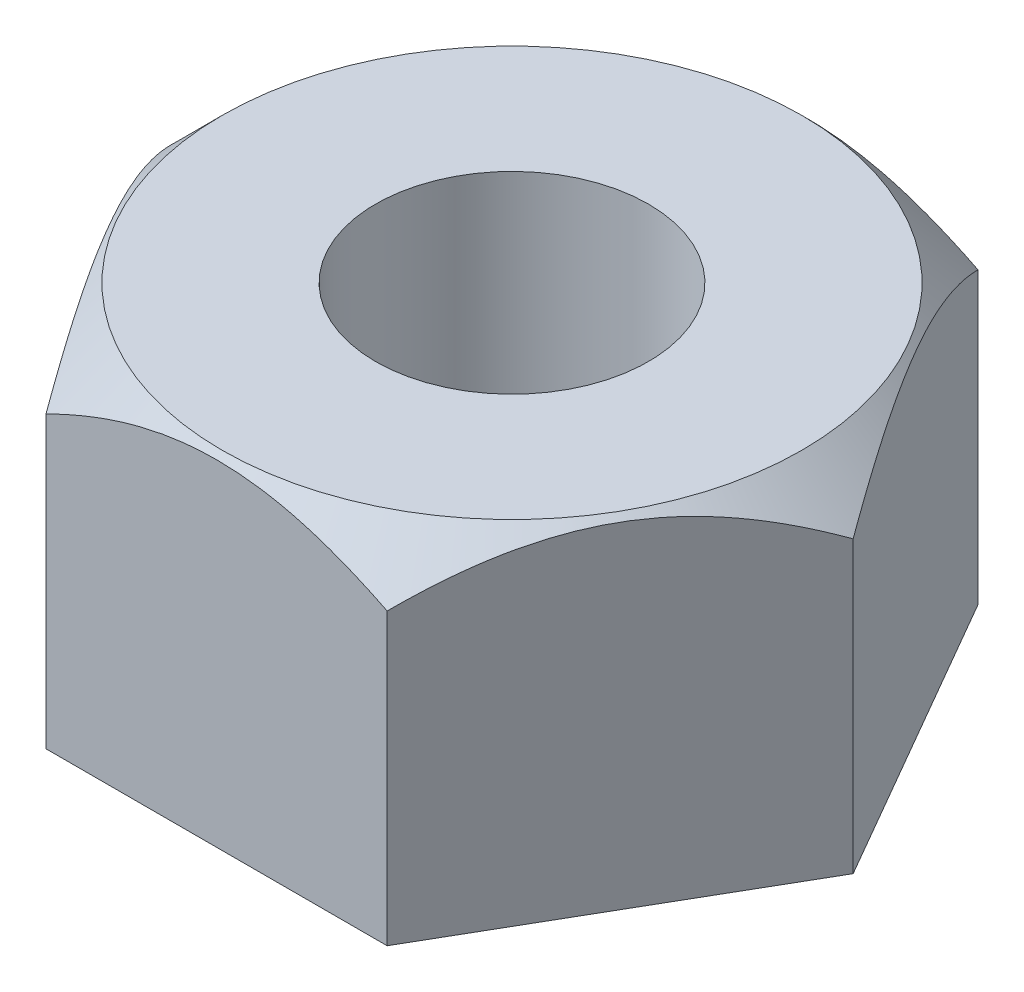
ISO-10303-21;
HEADER;
FILE_DESCRIPTION(('STEP AP214'),'2;1');
FILE_NAME('part.step','',(''),(''),'','','');
FILE_SCHEMA(('AUTOMOTIVE_DESIGN { 1 0 10303 214 1 1 1 1 }'));
ENDSEC;
DATA;
#1=APPLICATION_CONTEXT('core data for automotive mechanical design processes');
#2=APPLICATION_PROTOCOL_DEFINITION('international standard','automotive_design',2000,#1);
#3=PRODUCT_CONTEXT('',#1,'mechanical');
#4=PRODUCT('Part','Part','',(#3));
#5=PRODUCT_RELATED_PRODUCT_CATEGORY('part','',(#4));
#6=PRODUCT_DEFINITION_FORMATION('','',#4);
#7=PRODUCT_DEFINITION_CONTEXT('part definition',#1,'design');
#8=PRODUCT_DEFINITION('design','',#6,#7);
#9=PRODUCT_DEFINITION_SHAPE('','',#8);
#10=(LENGTH_UNIT() NAMED_UNIT(*) SI_UNIT(.MILLI.,.METRE.));
#11=(NAMED_UNIT(*) PLANE_ANGLE_UNIT() SI_UNIT($,.RADIAN.));
#12=(NAMED_UNIT(*) SI_UNIT($,.STERADIAN.) SOLID_ANGLE_UNIT());
#13=UNCERTAINTY_MEASURE_WITH_UNIT(LENGTH_MEASURE(1.E-05),#10,'distance_accuracy_value','');
#14=(GEOMETRIC_REPRESENTATION_CONTEXT(3) GLOBAL_UNCERTAINTY_ASSIGNED_CONTEXT((#13)) GLOBAL_UNIT_ASSIGNED_CONTEXT((#10,
#11,#12)) REPRESENTATION_CONTEXT('',''));
#15=CARTESIAN_POINT('',(0.,0.,0.));
#16=DIRECTION('',(0.,0.,1.));
#17=DIRECTION('',(1.,0.,0.));
#18=AXIS2_PLACEMENT_3D('',#15,#16,#17);
#19=CARTESIAN_POINT('',(0.,5.,0.));
#20=DIRECTION('',(0.,1.,0.));
#21=DIRECTION('',(0.,0.,1.));
#22=AXIS2_PLACEMENT_3D('',#19,#20,#21);
#23=PLANE('',#22);
#24=CARTESIAN_POINT('',(0.,5.,0.));
#25=DIRECTION('',(0.,1.,0.));
#26=DIRECTION('',(0.,0.,1.));
#27=AXIS2_PLACEMENT_3D('',#24,#25,#26);
#28=CIRCLE('',#27,2.);
#29=CARTESIAN_POINT('',(0.,5.,2.));
#30=VERTEX_POINT('',#29);
#31=EDGE_CURVE('E136',#30,#30,#28,.T.);
#32=ORIENTED_EDGE('',*,*,#31,.F.);
#33=EDGE_LOOP('',(#32));
#34=FACE_BOUND('',#33,.T.);
#35=CARTESIAN_POINT('',(0.,5.,0.));
#36=DIRECTION('',(0.,1.,0.));
#37=DIRECTION('',(0.,0.,1.));
#38=AXIS2_PLACEMENT_3D('',#35,#36,#37);
#39=CIRCLE('',#38,4.25);
#40=CARTESIAN_POINT('',(0.,5.,4.25));
#41=VERTEX_POINT('',#40);
#42=EDGE_CURVE('E199',#41,#41,#39,.T.);
#43=ORIENTED_EDGE('',*,*,#42,.T.);
#44=EDGE_LOOP('',(#43));
#45=FACE_BOUND('',#44,.T.);
#46=ADVANCED_FACE('F38',(#34,#45),#23,.T.);
#47=CARTESIAN_POINT('',(2.50000000000005,5.,4.33012701892216));
#48=DIRECTION('',(-0.866025403784441,0.,-0.499999999999995));
#49=DIRECTION('',(-0.499999999999995,0.,0.866025403784441));
#50=AXIS2_PLACEMENT_3D('',#47,#48,#49);
#51=PLANE('',#50);
#52=CARTESIAN_POINT('',(2.49988452994621,4.24988452594626,4.33032701892216));
#53=CARTESIAN_POINT('',(2.54287138041581,4.29286790141724,4.25587160985146));
#54=CARTESIAN_POINT('',(2.5861886533099,4.33453221602493,4.18084389235356));
#55=CARTESIAN_POINT('',(2.67354887274439,4.41482145708143,4.02953155373265));
#56=CARTESIAN_POINT('',(2.717592199979,4.45344472346907,3.95324627322793));
#57=CARTESIAN_POINT('',(2.85131771209202,4.56448044206777,3.72162689198));
#58=CARTESIAN_POINT('',(2.94213197757918,4.63158509551094,3.56433197010419));
#59=CARTESIAN_POINT('',(3.12526622915862,4.74649734778531,3.2471341417625));
#60=CARTESIAN_POINT('',(3.21753940303063,4.79459446311372,3.08731231644054));
#61=CARTESIAN_POINT('',(3.35746623690529,4.85023112471792,2.84495193082738));
#62=CARTESIAN_POINT('',(3.40431453249367,4.86601773556801,2.7638083026203));
#63=CARTESIAN_POINT('',(3.49840781373643,4.89173070196771,2.60083395885697));
#64=CARTESIAN_POINT('',(3.54565273902896,4.90165793340976,2.51900334785051));
#65=CARTESIAN_POINT('',(3.66078037944809,4.91830217314389,2.31959642528905));
#66=CARTESIAN_POINT('',(3.72878713668332,4.92179465880338,2.20180526649963));
#67=CARTESIAN_POINT('',(3.864678097949,4.91593410386714,1.9664352172981));
#68=CARTESIAN_POINT('',(3.93256225066697,4.90657656026428,1.8488564157618));
#69=CARTESIAN_POINT('',(4.06769057590288,4.87556753841817,1.61480729091151));
#70=CARTESIAN_POINT('',(4.13493394699396,4.85390231052961,1.49833835570955));
#71=CARTESIAN_POINT('',(4.26826494691759,4.79945578592571,1.26740228961786));
#72=CARTESIAN_POINT('',(4.33435266395689,4.76667534152198,1.15293500594956));
#73=CARTESIAN_POINT('',(4.4516735537138,4.69923386131425,0.949729264101406));
#74=CARTESIAN_POINT('',(4.50316644513572,4.66634609377105,0.860540959930006));
#75=CARTESIAN_POINT('',(4.60522781060439,4.59527048015555,0.683765489448405));
#76=CARTESIAN_POINT('',(4.6557962564957,4.55708247295944,0.596178371904862));
#77=CARTESIAN_POINT('',(4.7558494637635,4.47626249862795,0.422881133456812));
#78=CARTESIAN_POINT('',(4.80533707077894,4.4336445061233,0.337166083761062));
#79=CARTESIAN_POINT('',(4.90339584958639,4.34452416373331,0.167323296738404));
#80=CARTESIAN_POINT('',(4.95196756146993,4.29802419677496,0.0831946239455066));
#81=CARTESIAN_POINT('',(5.00011547005384,4.24988452594626,-0.000199999999999411));
#82=B_SPLINE_CURVE_WITH_KNOTS('',3,(#52,#53,#54,#55,#56,#57,#58,#59,#60,#61,#62,#63,#64,#65,#66,
#67,#68,#69,#70,#71,#72,#73,#74,#75,#76,#77,#78,#79,#80,#81),.UNSPECIFIED.,.F.,.F.,(4,2,2,2,2,2,
2,2,2,2,2,2,2,2,4),(0.,0.288343025050059,0.576842376266664,1.15695604992331,1.7278574729651,
2.01274823950901,2.29759640821261,2.70513724110402,3.11282092407138,3.52096095288676,
3.92906969271703,4.25324617843567,4.57743252106519,4.90062556888116,5.22362166510132),.UNSPECIFIED.);
#83=CARTESIAN_POINT('',(2.50000000000005,4.25,4.33012701892216));
#84=VERTEX_POINT('',#83);
#85=CARTESIAN_POINT('',(5.,4.25,0.));
#86=VERTEX_POINT('',#85);
#87=EDGE_CURVE('E97',#84,#86,#82,.T.);
#88=ORIENTED_EDGE('',*,*,#87,.F.);
#89=DIRECTION('',(0.,-1.,0.));
#90=VECTOR('',#89,1.);
#91=CARTESIAN_POINT('',(2.50000000000005,5.,4.33012701892216));
#92=LINE('',#91,#90);
#93=CARTESIAN_POINT('',(2.50000000000005,0.,4.33012701892216));
#94=VERTEX_POINT('',#93);
#95=EDGE_CURVE('E67',#84,#94,#92,.T.);
#96=ORIENTED_EDGE('',*,*,#95,.T.);
#97=DIRECTION('',(0.499999999999995,0.,-0.866025403784441));
#98=VECTOR('',#97,1.);
#99=CARTESIAN_POINT('',(2.50000000000005,0.,4.33012701892216));
#100=LINE('',#99,#98);
#101=CARTESIAN_POINT('',(5.,0.,0.));
#102=VERTEX_POINT('',#101);
#103=EDGE_CURVE('E131',#94,#102,#100,.T.);
#104=ORIENTED_EDGE('',*,*,#103,.T.);
#105=DIRECTION('',(0.,-1.,0.));
#106=VECTOR('',#105,1.);
#107=CARTESIAN_POINT('',(5.,5.,0.));
#108=LINE('',#107,#106);
#109=EDGE_CURVE('E53',#86,#102,#108,.T.);
#110=ORIENTED_EDGE('',*,*,#109,.F.);
#111=EDGE_LOOP('',(#88,#96,#104,#110));
#112=FACE_BOUND('',#111,.T.);
#113=ADVANCED_FACE('F40',(#112),#51,.F.);
#114=CARTESIAN_POINT('',(5.,5.,0.));
#115=DIRECTION('',(-0.866025403784438,0.,0.500000000000001));
#116=DIRECTION('',(0.500000000000001,0.,0.866025403784438));
#117=AXIS2_PLACEMENT_3D('',#114,#115,#116);
#118=PLANE('',#117);
#119=CARTESIAN_POINT('',(5.00011547005384,4.24988452594626,0.000200000000000087));
#120=CARTESIAN_POINT('',(4.95712861958424,4.29286790141724,-0.0742554090707055));
#121=CARTESIAN_POINT('',(4.91381134669015,4.33453221602493,-0.149283126568603));
#122=CARTESIAN_POINT('',(4.82645112725565,4.41482145708144,-0.300595465189513));
#123=CARTESIAN_POINT('',(4.78240780002104,4.45344472346907,-0.37688074569424));
#124=CARTESIAN_POINT('',(4.64868228790802,4.56448044206778,-0.608500126942165));
#125=CARTESIAN_POINT('',(4.55786802242086,4.63158509551095,-0.765795048817977));
#126=CARTESIAN_POINT('',(4.37473377084142,4.74649734778532,-1.08299287715967));
#127=CARTESIAN_POINT('',(4.2824605969694,4.79459446311374,-1.24281470248163));
#128=CARTESIAN_POINT('',(4.14253376309474,4.85023112471793,-1.4851750880948));
#129=CARTESIAN_POINT('',(4.09568546750636,4.86601773556802,-1.56631871630188));
#130=CARTESIAN_POINT('',(4.0015921862636,4.89173070196773,-1.72929306006521));
#131=CARTESIAN_POINT('',(3.95434726097107,4.90165793340978,-1.81112367107166));
#132=CARTESIAN_POINT('',(3.83921962055193,4.9183021731439,-2.01053059363313));
#133=CARTESIAN_POINT('',(3.7712128633167,4.9217946588034,-2.12832175242254));
#134=CARTESIAN_POINT('',(3.63532190205103,4.91593410386716,-2.36369180162407));
#135=CARTESIAN_POINT('',(3.56743774933305,4.9065765602643,-2.48127060316037));
#136=CARTESIAN_POINT('',(3.43230942409714,4.87556753841819,-2.71531972801066));
#137=CARTESIAN_POINT('',(3.36506605300606,4.85390231052963,-2.83178866321263));
#138=CARTESIAN_POINT('',(3.23173505308243,4.79945578592573,-3.06272472930431));
#139=CARTESIAN_POINT('',(3.16564733604313,4.766675341522,-3.1771920129726));
#140=CARTESIAN_POINT('',(3.04832644628622,4.69923386131427,-3.38039775482076));
#141=CARTESIAN_POINT('',(2.99683355486429,4.66634609377107,-3.46958605899217));
#142=CARTESIAN_POINT('',(2.89477218939561,4.59527048015556,-3.64636152947377));
#143=CARTESIAN_POINT('',(2.84420374350431,4.55708247295946,-3.73394864701732));
#144=CARTESIAN_POINT('',(2.7441505362365,4.47626249862796,-3.90724588546537));
#145=CARTESIAN_POINT('',(2.69466292922106,4.43364450612331,-3.99296093516113));
#146=CARTESIAN_POINT('',(2.59660415041361,4.34452416373332,-4.16280372218379));
#147=CARTESIAN_POINT('',(2.54803243853006,4.29802419677496,-4.24693239497669));
#148=CARTESIAN_POINT('',(2.49988452994615,4.24988452594626,-4.3303270189222));
#149=B_SPLINE_CURVE_WITH_KNOTS('',3,(#119,#120,#121,#122,#123,#124,#125,#126,#127,#128,#129,
#130,#131,#132,#133,#134,#135,#136,#137,#138,#139,#140,#141,#142,#143,#144,#145,#146,#147,#148),
.UNSPECIFIED.,.F.,.F.,(4,2,2,2,2,2,2,2,2,2,2,2,2,2,4),(0.,0.288343025050063,0.576842376266671,
1.15695604992333,1.72785747296513,2.01274823950904,2.29759640821264,2.70513724110405,
3.1128209240714,3.52096095288679,3.92906969271705,4.2532461784357,4.57743252106524,
4.90062556888122,5.22362166510139),.UNSPECIFIED.);
#150=CARTESIAN_POINT('',(2.50000000000005,4.25000000000001,-4.3301270189222));
#151=VERTEX_POINT('',#150);
#152=EDGE_CURVE('E103',#86,#151,#149,.T.);
#153=ORIENTED_EDGE('',*,*,#152,.F.);
#154=ORIENTED_EDGE('',*,*,#109,.T.);
#155=DIRECTION('',(-0.500000000000001,0.,-0.866025403784438));
#156=VECTOR('',#155,1.);
#157=CARTESIAN_POINT('',(5.,0.,0.));
#158=LINE('',#157,#156);
#159=CARTESIAN_POINT('',(2.49999999999999,0.,-4.3301270189222));
#160=VERTEX_POINT('',#159);
#161=EDGE_CURVE('E126',#102,#160,#158,.T.);
#162=ORIENTED_EDGE('',*,*,#161,.T.);
#163=DIRECTION('',(0.,-1.,0.));
#164=VECTOR('',#163,1.);
#165=CARTESIAN_POINT('',(2.49999999999999,5.,-4.3301270189222));
#166=LINE('',#165,#164);
#167=EDGE_CURVE('E120',#151,#160,#166,.T.);
#168=ORIENTED_EDGE('',*,*,#167,.F.);
#169=EDGE_LOOP('',(#153,#154,#162,#168));
#170=FACE_BOUND('',#169,.T.);
#171=ADVANCED_FACE('F124',(#170),#118,.F.);
#172=CARTESIAN_POINT('',(2.49999999999999,5.,-4.3301270189222));
#173=DIRECTION('',(0.,0.,1.));
#174=DIRECTION('',(1.,0.,0.));
#175=AXIS2_PLACEMENT_3D('',#172,#173,#174);
#176=PLANE('',#175);
#177=CARTESIAN_POINT('',(9.27001948867609,-0.981483827892917,-4.33012701892222));
#178=CARTESIAN_POINT('',(9.13465929281197,-0.858846237183765,-4.33012701892222));
#179=CARTESIAN_POINT('',(8.99906244678233,-0.736469689901133,-4.33012701892222));
#180=CARTESIAN_POINT('',(8.7273298644579,-0.492315989197444,-4.33012701892222));
#181=CARTESIAN_POINT('',(8.59119412721826,-0.370538836828162,-4.33012701892222));
#182=CARTESIAN_POINT('',(8.18180484789018,-0.00615537973493757,-4.33012701892222));
#183=CARTESIAN_POINT('',(7.90764462360564,0.235434472456178,-4.33012701892222));
#184=CARTESIAN_POINT('',(7.35378987250105,0.717161719053788,-4.33012701892221));
#185=CARTESIAN_POINT('',(7.07406787752908,0.957267645140985,-4.33012701892221));
#186=CARTESIAN_POINT('',(6.65137341172978,1.31368666088215,-4.33012701892221));
#187=CARTESIAN_POINT('',(6.50996924974581,1.43185945923318,-4.33012701892221));
#188=CARTESIAN_POINT('',(6.22593060200368,1.66673979169904,-4.33012701892221));
#189=CARTESIAN_POINT('',(6.08329602364803,1.78344721388211,-4.33012701892221));
#190=CARTESIAN_POINT('',(5.68737678127596,2.10339012036508,-4.33012701892221));
#191=CARTESIAN_POINT('',(5.43260203759546,2.30478992498999,-4.33012701892221));
#192=CARTESIAN_POINT('',(4.91726062816721,2.70003845017837,-4.33012701892221));
#193=CARTESIAN_POINT('',(4.65669478706164,2.89388823516738,-4.33012701892221));
#194=CARTESIAN_POINT('',(4.26016624310549,3.17624461534155,-4.3301270189222));
#195=CARTESIAN_POINT('',(4.12715219078482,3.26888954546586,-4.3301270189222));
#196=CARTESIAN_POINT('',(3.85883185971417,3.4507903715471,-4.3301270189222));
#197=CARTESIAN_POINT('',(3.723525750613,3.54004651675689,-4.3301270189222));
#198=CARTESIAN_POINT('',(3.45032045114124,3.71432903103367,-4.3301270189222));
#199=CARTESIAN_POINT('',(3.31242287908584,3.79935792640874,-4.3301270189222));
#200=CARTESIAN_POINT('',(3.03354766004797,3.96419284294416,-4.3301270189222));
#201=CARTESIAN_POINT('',(2.8925704457907,4.04399959165966,-4.3301270189222));
#202=CARTESIAN_POINT('',(2.61398683337434,4.19334291753103,-4.3301270189222));
#203=CARTESIAN_POINT('',(2.47654778902267,4.26318968165987,-4.3301270189222));
#204=CARTESIAN_POINT('',(2.19809428217838,4.39545479720467,-4.3301270189222));
#205=CARTESIAN_POINT('',(2.05707953768106,4.45787256049345,-4.3301270189222));
#206=CARTESIAN_POINT('',(1.77154795476023,4.57331609035159,-4.3301270189222));
#207=CARTESIAN_POINT('',(1.62703877948224,4.62636060440689,-4.3301270189222));
#208=CARTESIAN_POINT('',(1.33434760782554,4.72105455299639,-4.33012701892219));
#209=CARTESIAN_POINT('',(1.186167471675,4.76270963522978,-4.33012701892219));
#210=CARTESIAN_POINT('',(0.912146685329709,4.82649323885681,-4.33012701892219));
#211=CARTESIAN_POINT('',(0.786801944524102,4.85073957797645,-4.33012701892219));
#212=CARTESIAN_POINT('',(0.534528600177782,4.88878586845851,-4.33012701892219));
#213=CARTESIAN_POINT('',(0.407600225590743,4.90258731250199,-4.33012701892219));
#214=CARTESIAN_POINT('',(0.153185196011081,4.919021117253,-4.33012701892219));
#215=CARTESIAN_POINT('',(0.0256995313860898,4.92166859726373,-4.33012701892219));
#216=CARTESIAN_POINT('',(-0.229008761715775,4.91569123688985,-4.33012701892219));
#217=CARTESIAN_POINT('',(-0.356231379018607,4.90706592711422,-4.33012701892219));
#218=CARTESIAN_POINT('',(-0.608878772188723,4.87906941011197,-4.33012701892219));
#219=CARTESIAN_POINT('',(-0.734309120097854,4.8597477132314,-4.33012701892219));
#220=CARTESIAN_POINT('',(-0.983272347303113,4.81131769136306,-4.33012701892219));
#221=CARTESIAN_POINT('',(-1.10680474697478,4.78220693380588,-4.33012701892219));
#222=CARTESIAN_POINT('',(-1.35177914507599,4.71531370595252,-4.33012701892219));
#223=CARTESIAN_POINT('',(-1.47321565620648,4.6775113616126,-4.33012701892219));
#224=CARTESIAN_POINT('',(-1.71350214415984,4.5945327253728,-4.33012701892218));
#225=CARTESIAN_POINT('',(-1.8323523419659,4.54935706629932,-4.33012701892218));
#226=CARTESIAN_POINT('',(-2.12604075386358,4.42877312835611,-4.33012701892218));
#227=CARTESIAN_POINT('',(-2.29929295168307,4.34951102750412,-4.33012701892218));
#228=CARTESIAN_POINT('',(-2.64059388612086,4.18040963721588,-4.33012701892218));
#229=CARTESIAN_POINT('',(-2.80863942350524,4.09056400136195,-4.33012701892218));
#230=CARTESIAN_POINT('',(-3.14053942143819,3.90264158423413,-4.33012701892218));
#231=CARTESIAN_POINT('',(-3.30438333769755,3.8045463216484,-4.33012701892218));
#232=CARTESIAN_POINT('',(-3.62815537830474,3.60220829919812,-4.33012701892218));
#233=CARTESIAN_POINT('',(-3.78808430166,3.49796680876677,-4.33012701892218));
#234=CARTESIAN_POINT('',(-4.10626172745654,3.28364174746087,-4.33012701892218));
#235=CARTESIAN_POINT('',(-4.26447809792633,3.17351069640275,-4.33012701892218));
#236=CARTESIAN_POINT('',(-4.57816177545007,2.94940241167162,-4.33012701892217));
#237=CARTESIAN_POINT('',(-4.73362897409936,2.83542502684404,-4.33012701892217));
#238=CARTESIAN_POINT('',(-5.04206107712258,2.60455521995252,-4.33012701892217));
#239=CARTESIAN_POINT('',(-5.19502898153489,2.48766679505953,-4.33012701892217));
#240=CARTESIAN_POINT('',(-5.49903835879257,2.25140749914149,-4.33012701892217));
#241=CARTESIAN_POINT('',(-5.65007977147794,2.13203655089752,-4.33012701892217));
#242=CARTESIAN_POINT('',(-6.10188511533437,1.77000748257263,-4.33012701892217));
#243=CARTESIAN_POINT('',(-6.40019792209626,1.52429138138432,-4.33012701892217));
#244=CARTESIAN_POINT('',(-6.99219777051342,1.02715813809715,-4.33012701892217));
#245=CARTESIAN_POINT('',(-7.28588299974792,0.775738851958045,-4.33012701892217));
#246=CARTESIAN_POINT('',(-7.86278222668579,0.274847242242779,-4.33012701892216));
#247=CARTESIAN_POINT('',(-8.14607928343296,0.0254704251672079,-4.33012701892216));
#248=CARTESIAN_POINT('',(-8.56900239033586,-0.350712617655279,-4.33012701892216));
#249=CARTESIAN_POINT('',(-8.70960309025214,-0.4764267054582,-4.33012701892216));
#250=CARTESIAN_POINT('',(-8.99022641347446,-0.728495635433105,-4.33012701892216));
#251=CARTESIAN_POINT('',(-9.13024904277475,-0.854850470930472,-4.33012701892216));
#252=CARTESIAN_POINT('',(-9.27001948867612,-0.981483827892917,-4.33012701892216));
#253=B_SPLINE_CURVE_WITH_KNOTS('',3,(#177,#178,#179,#180,#181,#182,#183,#184,#185,#186,#187,
#188,#189,#190,#191,#192,#193,#194,#195,#196,#197,#198,#199,#200,#201,#202,#203,#204,#205,#206,
#207,#208,#209,#210,#211,#212,#213,#214,#215,#216,#217,#218,#219,#220,#221,#222,#223,#224,#225,
#226,#227,#228,#229,#230,#231,#232,#233,#234,#235,#236,#237,#238,#239,#240,#241,#242,#243,#244,
#245,#246,#247,#248,#249,#250,#251,#252),.UNSPECIFIED.,.F.,.F.,(4,2,2,2,2,2,2,2,2,2,2,2,2,2,2,2,
2,2,2,2,2,2,2,2,2,2,2,2,2,2,2,2,2,2,2,2,2,4),(0.,0.547960621285619,1.09592220374854,
2.19215083672557,3.29802204795693,3.85086042637451,4.4037407791813,5.37794379591169,
6.35200896556431,6.83826356632775,7.32448233239408,7.81040694041205,8.2962637041039,
8.75859300800229,9.22095888853174,9.68238925500488,10.1435903944407,10.5262032584514,
10.908761432887,11.2908008789412,11.6728562333559,12.0531577787136,12.4335538984555,
12.8148286318756,13.1960706589788,13.7671267420242,14.3385270189786,14.9112433410001,
15.4838417865669,16.062087805091,16.6403565742516,17.2178708932913,17.7954032028669,
18.9547284591794,20.1144970190122,21.2467291212422,21.8125486257511,22.3783622482219),.UNSPECIFIED.);
#254=CARTESIAN_POINT('',(-2.50000000000002,4.25,-4.33012701892218));
#255=VERTEX_POINT('',#254);
#256=EDGE_CURVE('E158',#151,#255,#253,.T.);
#257=ORIENTED_EDGE('',*,*,#256,.F.);
#258=ORIENTED_EDGE('',*,*,#167,.T.);
#259=DIRECTION('',(-1.,0.,0.));
#260=VECTOR('',#259,1.);
#261=CARTESIAN_POINT('',(2.49999999999999,0.,-4.3301270189222));
#262=LINE('',#261,#260);
#263=CARTESIAN_POINT('',(-2.50000000000002,0.,-4.33012701892218));
#264=VERTEX_POINT('',#263);
#265=EDGE_CURVE('E134',#160,#264,#262,.T.);
#266=ORIENTED_EDGE('',*,*,#265,.T.);
#267=DIRECTION('',(0.,-1.,0.));
#268=VECTOR('',#267,1.);
#269=CARTESIAN_POINT('',(-2.50000000000002,5.,-4.33012701892218));
#270=LINE('',#269,#268);
#271=EDGE_CURVE('E118',#255,#264,#270,.T.);
#272=ORIENTED_EDGE('',*,*,#271,.F.);
#273=EDGE_LOOP('',(#257,#258,#266,#272));
#274=FACE_BOUND('',#273,.T.);
#275=ADVANCED_FACE('F157',(#274),#176,.F.);
#276=CARTESIAN_POINT('',(-2.50000000000002,5.,-4.33012701892218));
#277=DIRECTION('',(0.866025403784442,0.,0.499999999999995));
#278=DIRECTION('',(0.499999999999995,0.,-0.866025403784442));
#279=AXIS2_PLACEMENT_3D('',#276,#277,#278);
#280=PLANE('',#279);
#281=CARTESIAN_POINT('',(-2.49988452994618,4.24988452594626,-4.33032701892218));
#282=CARTESIAN_POINT('',(-2.54287138041578,4.29286790141724,-4.25587160985148));
#283=CARTESIAN_POINT('',(-2.58618865330987,4.33453221602493,-4.18084389235358));
#284=CARTESIAN_POINT('',(-2.67354887274436,4.41482145708144,-4.02953155373267));
#285=CARTESIAN_POINT('',(-2.71759219997897,4.45344472346907,-3.95324627322794));
#286=CARTESIAN_POINT('',(-2.851317712092,4.56448044206777,-3.72162689198001));
#287=CARTESIAN_POINT('',(-2.94213197757916,4.63158509551095,-3.5643319701042));
#288=CARTESIAN_POINT('',(-3.1252662291586,4.74649734778532,-3.24713414176251));
#289=CARTESIAN_POINT('',(-3.21753940303061,4.79459446311374,-3.08731231644054));
#290=CARTESIAN_POINT('',(-3.35746623690527,4.85023112471793,-2.84495193082738));
#291=CARTESIAN_POINT('',(-3.40431453249365,4.86601773556802,-2.7638083026203));
#292=CARTESIAN_POINT('',(-3.49840781373641,4.89173070196773,-2.60083395885697));
#293=CARTESIAN_POINT('',(-3.54565273902894,4.90165793340978,-2.51900334785051));
#294=CARTESIAN_POINT('',(-3.66078037944807,4.9183021731439,-2.31959642528904));
#295=CARTESIAN_POINT('',(-3.7287871366833,4.9217946588034,-2.20180526649963));
#296=CARTESIAN_POINT('',(-3.86467809794898,4.91593410386716,-1.9664352172981));
#297=CARTESIAN_POINT('',(-3.93256225066695,4.9065765602643,-1.8488564157618));
#298=CARTESIAN_POINT('',(-4.06769057590286,4.87556753841819,-1.61480729091151));
#299=CARTESIAN_POINT('',(-4.13493394699394,4.85390231052963,-1.49833835570955));
#300=CARTESIAN_POINT('',(-4.26826494691757,4.79945578592573,-1.26740228961786));
#301=CARTESIAN_POINT('',(-4.33435266395686,4.766675341522,-1.15293500594957));
#302=CARTESIAN_POINT('',(-4.45167355371377,4.69923386131427,-0.949729264101405));
#303=CARTESIAN_POINT('',(-4.5031664451357,4.66634609377107,-0.860540959930001));
#304=CARTESIAN_POINT('',(-4.60522781060438,4.59527048015556,-0.683765489448394));
#305=CARTESIAN_POINT('',(-4.65579625649569,4.55708247295946,-0.596178371904847));
#306=CARTESIAN_POINT('',(-4.75584946376349,4.47626249862796,-0.422881133456792));
#307=CARTESIAN_POINT('',(-4.80533707077893,4.43364450612331,-0.337166083761039));
#308=CARTESIAN_POINT('',(-4.90339584958638,4.34452416373332,-0.167323296738375));
#309=CARTESIAN_POINT('',(-4.95196756146993,4.29802419677496,-0.0831946239454745));
#310=CARTESIAN_POINT('',(-5.00011547005384,4.24988452594626,0.000200000000034478));
#311=B_SPLINE_CURVE_WITH_KNOTS('',3,(#281,#282,#283,#284,#285,#286,#287,#288,#289,#290,#291,
#292,#293,#294,#295,#296,#297,#298,#299,#300,#301,#302,#303,#304,#305,#306,#307,#308,#309,#310),
.UNSPECIFIED.,.F.,.F.,(4,2,2,2,2,2,2,2,2,2,2,2,2,2,4),(0.,0.288343025050063,0.576842376266671,
1.15695604992333,1.72785747296513,2.01274823950904,2.29759640821264,2.70513724110405,
3.1128209240714,3.52096095288679,3.92906969271705,4.2532461784357,4.57743252106524,
4.90062556888122,5.22362166510139),.UNSPECIFIED.);
#312=CARTESIAN_POINT('',(-5.,4.25,0.));
#313=VERTEX_POINT('',#312);
#314=EDGE_CURVE('E154',#255,#313,#311,.T.);
#315=ORIENTED_EDGE('',*,*,#314,.F.);
#316=ORIENTED_EDGE('',*,*,#271,.T.);
#317=DIRECTION('',(-0.499999999999995,0.,0.866025403784441));
#318=VECTOR('',#317,1.);
#319=CARTESIAN_POINT('',(-2.50000000000002,0.,-4.33012701892218));
#320=LINE('',#319,#318);
#321=CARTESIAN_POINT('',(-5.,0.,0.));
#322=VERTEX_POINT('',#321);
#323=EDGE_CURVE('E143',#264,#322,#320,.T.);
#324=ORIENTED_EDGE('',*,*,#323,.T.);
#325=DIRECTION('',(0.,-1.,0.));
#326=VECTOR('',#325,1.);
#327=CARTESIAN_POINT('',(-5.,5.,0.));
#328=LINE('',#327,#326);
#329=EDGE_CURVE('E111',#313,#322,#328,.T.);
#330=ORIENTED_EDGE('',*,*,#329,.F.);
#331=EDGE_LOOP('',(#315,#316,#324,#330));
#332=FACE_BOUND('',#331,.T.);
#333=ADVANCED_FACE('F152',(#332),#280,.F.);
#334=CARTESIAN_POINT('',(-5.,5.,0.));
#335=DIRECTION('',(0.866025403784435,0.,-0.500000000000007));
#336=DIRECTION('',(-0.500000000000007,0.,-0.866025403784435));
#337=AXIS2_PLACEMENT_3D('',#334,#335,#336);
#338=PLANE('',#337);
#339=CARTESIAN_POINT('',(-5.00011547005384,4.24988452594626,-0.000199999999965171));
#340=CARTESIAN_POINT('',(-4.95712861958424,4.29286790141724,0.0742554090707404));
#341=CARTESIAN_POINT('',(-4.91381134669015,4.33453221602493,0.149283126568638));
#342=CARTESIAN_POINT('',(-4.82645112725565,4.41482145708144,0.300595465189546));
#343=CARTESIAN_POINT('',(-4.78240780002104,4.45344472346907,0.376880745694273));
#344=CARTESIAN_POINT('',(-4.64868228790801,4.56448044206778,0.608500126942196));
#345=CARTESIAN_POINT('',(-4.55786802242085,4.63158509551095,0.765795048818007));
#346=CARTESIAN_POINT('',(-4.37473377084141,4.74649734778532,1.0829928771597));
#347=CARTESIAN_POINT('',(-4.28246059696939,4.79459446311373,1.24281470248166));
#348=CARTESIAN_POINT('',(-4.14253376309473,4.85023112471793,1.48517508809483));
#349=CARTESIAN_POINT('',(-4.09568546750635,4.86601773556802,1.56631871630191));
#350=CARTESIAN_POINT('',(-4.00159218626359,4.89173070196773,1.72929306006524));
#351=CARTESIAN_POINT('',(-3.95434726097106,4.90165793340978,1.81112367107169));
#352=CARTESIAN_POINT('',(-3.83921962055192,4.9183021731439,2.01053059363316));
#353=CARTESIAN_POINT('',(-3.77121286331669,4.9217946588034,2.12832175242257));
#354=CARTESIAN_POINT('',(-3.63532190205101,4.91593410386716,2.3636918016241));
#355=CARTESIAN_POINT('',(-3.56743774933303,4.9065765602643,2.4812706031604));
#356=CARTESIAN_POINT('',(-3.43230942409712,4.87556753841819,2.71531972801068));
#357=CARTESIAN_POINT('',(-3.36506605300604,4.85390231052962,2.83178866321265));
#358=CARTESIAN_POINT('',(-3.23173505308241,4.79945578592573,3.06272472930433));
#359=CARTESIAN_POINT('',(-3.16564733604311,4.766675341522,3.17719201297263));
#360=CARTESIAN_POINT('',(-3.0483264462862,4.69923386131427,3.38039775482078));
#361=CARTESIAN_POINT('',(-2.99683355486427,4.66634609377107,3.46958605899219));
#362=CARTESIAN_POINT('',(-2.89477218939559,4.59527048015556,3.64636152947379));
#363=CARTESIAN_POINT('',(-2.84420374350428,4.55708247295946,3.73394864701734));
#364=CARTESIAN_POINT('',(-2.74415053623648,4.47626249862796,3.90724588546539));
#365=CARTESIAN_POINT('',(-2.69466292922103,4.43364450612331,3.99296093516114));
#366=CARTESIAN_POINT('',(-2.59660415041358,4.34452416373332,4.16280372218381));
#367=CARTESIAN_POINT('',(-2.54803243853003,4.29802419677496,4.24693239497671));
#368=CARTESIAN_POINT('',(-2.49988452994612,4.24988452594626,4.33032701892221));
#369=B_SPLINE_CURVE_WITH_KNOTS('',3,(#339,#340,#341,#342,#343,#344,#345,#346,#347,#348,#349,
#350,#351,#352,#353,#354,#355,#356,#357,#358,#359,#360,#361,#362,#363,#364,#365,#366,#367,#368),
.UNSPECIFIED.,.F.,.F.,(4,2,2,2,2,2,2,2,2,2,2,2,2,2,4),(0.,0.288343025050063,0.576842376266669,
1.15695604992332,1.72785747296513,2.01274823950903,2.29759640821264,2.70513724110405,
3.1128209240714,3.52096095288678,3.92906969271705,4.2532461784357,4.57743252106523,
4.90062556888122,5.22362166510139),.UNSPECIFIED.);
#370=CARTESIAN_POINT('',(-2.49999999999996,4.25,4.33012701892222));
#371=VERTEX_POINT('',#370);
#372=EDGE_CURVE('E59',#313,#371,#369,.T.);
#373=ORIENTED_EDGE('',*,*,#372,.F.);
#374=ORIENTED_EDGE('',*,*,#329,.T.);
#375=DIRECTION('',(0.500000000000007,0.,0.866025403784434));
#376=VECTOR('',#375,1.);
#377=CARTESIAN_POINT('',(-5.,0.,0.));
#378=LINE('',#377,#376);
#379=CARTESIAN_POINT('',(-2.49999999999996,0.,4.33012701892222));
#380=VERTEX_POINT('',#379);
#381=EDGE_CURVE('E113',#322,#380,#378,.T.);
#382=ORIENTED_EDGE('',*,*,#381,.T.);
#383=DIRECTION('',(0.,-1.,0.));
#384=VECTOR('',#383,1.);
#385=CARTESIAN_POINT('',(-2.49999999999996,5.,4.33012701892222));
#386=LINE('',#385,#384);
#387=EDGE_CURVE('E109',#371,#380,#386,.T.);
#388=ORIENTED_EDGE('',*,*,#387,.F.);
#389=EDGE_LOOP('',(#373,#374,#382,#388));
#390=FACE_BOUND('',#389,.T.);
#391=ADVANCED_FACE('F148',(#390),#338,.F.);
#392=CARTESIAN_POINT('',(-2.49999999999996,5.,4.33012701892222));
#393=DIRECTION('',(0.,0.,-1.));
#394=DIRECTION('',(-1.,0.,0.));
#395=AXIS2_PLACEMENT_3D('',#392,#393,#394);
#396=PLANE('',#395);
#397=CARTESIAN_POINT('',(-9.27001948867606,-0.981483827892917,4.33012701892229));
#398=CARTESIAN_POINT('',(-9.13465929281194,-0.858846237183764,4.33012701892228));
#399=CARTESIAN_POINT('',(-8.9990624467823,-0.736469689901131,4.33012701892228));
#400=CARTESIAN_POINT('',(-8.72732986445787,-0.492315989197443,4.33012701892228));
#401=CARTESIAN_POINT('',(-8.59119412721823,-0.370538836828161,4.33012701892228));
#402=CARTESIAN_POINT('',(-8.18180484789015,-0.00615537973493865,4.33012701892227));
#403=CARTESIAN_POINT('',(-7.90764462360561,0.235434472456177,4.33012701892227));
#404=CARTESIAN_POINT('',(-7.35378987250102,0.717161719053788,4.33012701892227));
#405=CARTESIAN_POINT('',(-7.07406787752905,0.957267645140987,4.33012701892226));
#406=CARTESIAN_POINT('',(-6.65137341172975,1.31368666088215,4.33012701892226));
#407=CARTESIAN_POINT('',(-6.50996924974578,1.43185945923318,4.33012701892226));
#408=CARTESIAN_POINT('',(-6.22593060200365,1.66673979169904,4.33012701892225));
#409=CARTESIAN_POINT('',(-6.083296023648,1.78344721388211,4.33012701892225));
#410=CARTESIAN_POINT('',(-5.68737678127593,2.10339012036508,4.33012701892225));
#411=CARTESIAN_POINT('',(-5.43260203759543,2.30478992498999,4.33012701892225));
#412=CARTESIAN_POINT('',(-4.91726062816718,2.70003845017837,4.33012701892224));
#413=CARTESIAN_POINT('',(-4.65669478706161,2.89388823516738,4.33012701892224));
#414=CARTESIAN_POINT('',(-4.26016624310546,3.17624461534155,4.33012701892223));
#415=CARTESIAN_POINT('',(-4.12715219078479,3.26888954546586,4.33012701892223));
#416=CARTESIAN_POINT('',(-3.85883185971414,3.4507903715471,4.33012701892223));
#417=CARTESIAN_POINT('',(-3.72352575061297,3.54004651675689,4.33012701892223));
#418=CARTESIAN_POINT('',(-3.45032045114121,3.71432903103367,4.33012701892223));
#419=CARTESIAN_POINT('',(-3.31242287908581,3.79935792640874,4.33012701892222));
#420=CARTESIAN_POINT('',(-3.03354766004794,3.96419284294416,4.33012701892222));
#421=CARTESIAN_POINT('',(-2.89257044579067,4.04399959165966,4.33012701892222));
#422=CARTESIAN_POINT('',(-2.61398683337431,4.19334291753103,4.33012701892222));
#423=CARTESIAN_POINT('',(-2.47654778902263,4.26318968165987,4.33012701892222));
#424=CARTESIAN_POINT('',(-2.19809428217835,4.39545479720467,4.33012701892221));
#425=CARTESIAN_POINT('',(-2.05707953768103,4.45787256049345,4.33012701892221));
#426=CARTESIAN_POINT('',(-1.7715479547602,4.57331609035159,4.33012701892221));
#427=CARTESIAN_POINT('',(-1.62703877948221,4.62636060440689,4.33012701892221));
#428=CARTESIAN_POINT('',(-1.33434760782551,4.72105455299639,4.3301270189222));
#429=CARTESIAN_POINT('',(-1.18616747167497,4.76270963522978,4.3301270189222));
#430=CARTESIAN_POINT('',(-0.912146685329678,4.82649323885681,4.3301270189222));
#431=CARTESIAN_POINT('',(-0.786801944524071,4.85073957797645,4.3301270189222));
#432=CARTESIAN_POINT('',(-0.53452860017775,4.88878586845851,4.3301270189222));
#433=CARTESIAN_POINT('',(-0.407600225590711,4.90258731250199,4.33012701892219));
#434=CARTESIAN_POINT('',(-0.153185196011048,4.919021117253,4.33012701892219));
#435=CARTESIAN_POINT('',(-0.0256995313860572,4.92166859726373,4.33012701892219));
#436=CARTESIAN_POINT('',(0.229008761715808,4.91569123688986,4.33012701892219));
#437=CARTESIAN_POINT('',(0.35623137901864,4.90706592711422,4.33012701892219));
#438=CARTESIAN_POINT('',(0.608878772188755,4.87906941011197,4.33012701892218));
#439=CARTESIAN_POINT('',(0.734309120097887,4.8597477132314,4.33012701892218));
#440=CARTESIAN_POINT('',(0.983272347303146,4.81131769136306,4.33012701892218));
#441=CARTESIAN_POINT('',(1.10680474697481,4.78220693380588,4.33012701892218));
#442=CARTESIAN_POINT('',(1.35177914507602,4.71531370595252,4.33012701892217));
#443=CARTESIAN_POINT('',(1.47321565620652,4.6775113616126,4.33012701892217));
#444=CARTESIAN_POINT('',(1.71350214415987,4.59453272537279,4.33012701892217));
#445=CARTESIAN_POINT('',(1.83235234196593,4.54935706629932,4.33012701892217));
#446=CARTESIAN_POINT('',(2.12604075386362,4.42877312835611,4.33012701892217));
#447=CARTESIAN_POINT('',(2.29929295168311,4.34951102750412,4.33012701892217));
#448=CARTESIAN_POINT('',(2.6405938861209,4.18040963721588,4.33012701892216));
#449=CARTESIAN_POINT('',(2.80863942350527,4.09056400136194,4.33012701892216));
#450=CARTESIAN_POINT('',(3.14053942143823,3.90264158423413,4.33012701892216));
#451=CARTESIAN_POINT('',(3.30438333769759,3.8045463216484,4.33012701892216));
#452=CARTESIAN_POINT('',(3.62815537830478,3.60220829919812,4.33012701892215));
#453=CARTESIAN_POINT('',(3.78808430166003,3.49796680876677,4.33012701892215));
#454=CARTESIAN_POINT('',(4.10626172745657,3.28364174746086,4.33012701892215));
#455=CARTESIAN_POINT('',(4.26447809792636,3.17351069640275,4.33012701892215));
#456=CARTESIAN_POINT('',(4.5781617754501,2.94940241167161,4.33012701892214));
#457=CARTESIAN_POINT('',(4.7336289740994,2.83542502684403,4.33012701892214));
#458=CARTESIAN_POINT('',(5.04206107712262,2.60455521995251,4.33012701892214));
#459=CARTESIAN_POINT('',(5.19502898153493,2.48766679505953,4.33012701892214));
#460=CARTESIAN_POINT('',(5.49903835879261,2.25140749914148,4.33012701892213));
#461=CARTESIAN_POINT('',(5.65007977147797,2.13203655089751,4.33012701892213));
#462=CARTESIAN_POINT('',(6.1018851153344,1.77000748257263,4.33012701892213));
#463=CARTESIAN_POINT('',(6.40019792209629,1.52429138138432,4.33012701892212));
#464=CARTESIAN_POINT('',(6.99219777051345,1.02715813809715,4.33012701892212));
#465=CARTESIAN_POINT('',(7.28588299974795,0.775738851958045,4.33012701892211));
#466=CARTESIAN_POINT('',(7.86278222668582,0.274847242242781,4.33012701892211));
#467=CARTESIAN_POINT('',(8.14607928343299,0.025470425167211,4.3301270189221));
#468=CARTESIAN_POINT('',(8.56900239033589,-0.350712617655276,4.3301270189221));
#469=CARTESIAN_POINT('',(8.70960309025217,-0.476426705458196,4.3301270189221));
#470=CARTESIAN_POINT('',(8.99022641347448,-0.728495635433103,4.3301270189221));
#471=CARTESIAN_POINT('',(9.13024904277478,-0.854850470930471,4.3301270189221));
#472=CARTESIAN_POINT('',(9.27001948867615,-0.981483827892916,4.33012701892209));
#473=B_SPLINE_CURVE_WITH_KNOTS('',3,(#397,#398,#399,#400,#401,#402,#403,#404,#405,#406,#407,
#408,#409,#410,#411,#412,#413,#414,#415,#416,#417,#418,#419,#420,#421,#422,#423,#424,#425,#426,
#427,#428,#429,#430,#431,#432,#433,#434,#435,#436,#437,#438,#439,#440,#441,#442,#443,#444,#445,
#446,#447,#448,#449,#450,#451,#452,#453,#454,#455,#456,#457,#458,#459,#460,#461,#462,#463,#464,
#465,#466,#467,#468,#469,#470,#471,#472),.UNSPECIFIED.,.F.,.F.,(4,2,2,2,2,2,2,2,2,2,2,2,2,2,2,2,
2,2,2,2,2,2,2,2,2,2,2,2,2,2,2,2,2,2,2,2,2,4),(0.,0.54796062128562,1.09592220374854,
2.19215083672557,3.29802204795693,3.85086042637451,4.4037407791813,5.37794379591169,
6.35200896556431,6.83826356632775,7.32448233239408,7.81040694041205,8.2962637041039,
8.75859300800228,9.22095888853174,9.68238925500487,10.1435903944407,10.5262032584514,
10.908761432887,11.2908008789412,11.6728562333559,12.0531577787136,12.4335538984555,
12.8148286318756,13.1960706589788,13.7671267420242,14.3385270189786,14.9112433410001,
15.4838417865669,16.062087805091,16.6403565742516,17.2178708932913,17.7954032028669,
18.9547284591794,20.1144970190122,21.2467291212422,21.8125486257511,22.3783622482219),.UNSPECIFIED.);
#474=EDGE_CURVE('E12',#371,#84,#473,.T.);
#475=ORIENTED_EDGE('',*,*,#474,.F.);
#476=ORIENTED_EDGE('',*,*,#387,.T.);
#477=DIRECTION('',(1.,0.,0.));
#478=VECTOR('',#477,1.);
#479=CARTESIAN_POINT('',(-2.49999999999996,0.,4.33012701892222));
#480=LINE('',#479,#478);
#481=EDGE_CURVE('E107',#380,#94,#480,.T.);
#482=ORIENTED_EDGE('',*,*,#481,.T.);
#483=ORIENTED_EDGE('',*,*,#95,.F.);
#484=EDGE_LOOP('',(#475,#476,#482,#483));
#485=FACE_BOUND('',#484,.T.);
#486=ADVANCED_FACE('F105',(#485),#396,.F.);
#487=CARTESIAN_POINT('',(0.,0.,0.));
#488=DIRECTION('',(0.,1.,0.));
#489=DIRECTION('',(0.,0.,1.));
#490=AXIS2_PLACEMENT_3D('',#487,#488,#489);
#491=PLANE('',#490);
#492=ORIENTED_EDGE('',*,*,#103,.F.);
#493=ORIENTED_EDGE('',*,*,#481,.F.);
#494=ORIENTED_EDGE('',*,*,#381,.F.);
#495=ORIENTED_EDGE('',*,*,#323,.F.);
#496=ORIENTED_EDGE('',*,*,#265,.F.);
#497=ORIENTED_EDGE('',*,*,#161,.F.);
#498=EDGE_LOOP('',(#492,#493,#494,#495,#496,#497));
#499=FACE_BOUND('',#498,.T.);
#500=CARTESIAN_POINT('',(0.,0.,0.));
#501=DIRECTION('',(0.,1.,0.));
#502=DIRECTION('',(0.,0.,1.));
#503=AXIS2_PLACEMENT_3D('',#500,#501,#502);
#504=CIRCLE('',#503,2.);
#505=CARTESIAN_POINT('',(0.,0.,2.));
#506=VERTEX_POINT('',#505);
#507=EDGE_CURVE('E102',#506,#506,#504,.T.);
#508=ORIENTED_EDGE('',*,*,#507,.T.);
#509=EDGE_LOOP('',(#508));
#510=FACE_BOUND('',#509,.T.);
#511=ADVANCED_FACE('F129',(#499,#510),#491,.F.);
#512=CARTESIAN_POINT('',(0.,5.,0.));
#513=DIRECTION('',(0.,-1.,0.));
#514=DIRECTION('',(0.,0.,-1.));
#515=AXIS2_PLACEMENT_3D('',#512,#513,#514);
#516=CYLINDRICAL_SURFACE('',#515,2.);
#517=ORIENTED_EDGE('',*,*,#31,.T.);
#518=EDGE_LOOP('',(#517));
#519=FACE_BOUND('',#518,.T.);
#520=ORIENTED_EDGE('',*,*,#507,.F.);
#521=EDGE_LOOP('',(#520));
#522=FACE_BOUND('',#521,.T.);
#523=ADVANCED_FACE('F181',(#519,#522),#516,.F.);
#524=CARTESIAN_POINT('',(0.,5.,0.));
#525=DIRECTION('',(0.,-1.,0.));
#526=DIRECTION('',(0.,0.,1.));
#527=AXIS2_PLACEMENT_3D('',#524,#525,#526);
#528=CONICAL_SURFACE('',#527,4.25,0.78539816339745);
#529=ORIENTED_EDGE('',*,*,#42,.F.);
#530=EDGE_LOOP('',(#529));
#531=FACE_BOUND('',#530,.T.);
#532=ORIENTED_EDGE('',*,*,#87,.T.);
#533=ORIENTED_EDGE('',*,*,#152,.T.);
#534=ORIENTED_EDGE('',*,*,#256,.T.);
#535=ORIENTED_EDGE('',*,*,#314,.T.);
#536=ORIENTED_EDGE('',*,*,#372,.T.);
#537=ORIENTED_EDGE('',*,*,#474,.T.);
#538=EDGE_LOOP('',(#532,#533,#534,#535,#536,#537));
#539=FACE_BOUND('',#538,.T.);
#540=ADVANCED_FACE('F96',(#531,#539),#528,.T.);
#541=CLOSED_SHELL('',(#46,#113,#171,#275,#333,#391,#486,#511,#523,#540));
#542=MANIFOLD_SOLID_BREP('B2',#541);
#543=ADVANCED_BREP_SHAPE_REPRESENTATION('',(#18,#542),#14);
#544=SHAPE_DEFINITION_REPRESENTATION(#9,#543);
ENDSEC;
END-ISO-10303-21;
